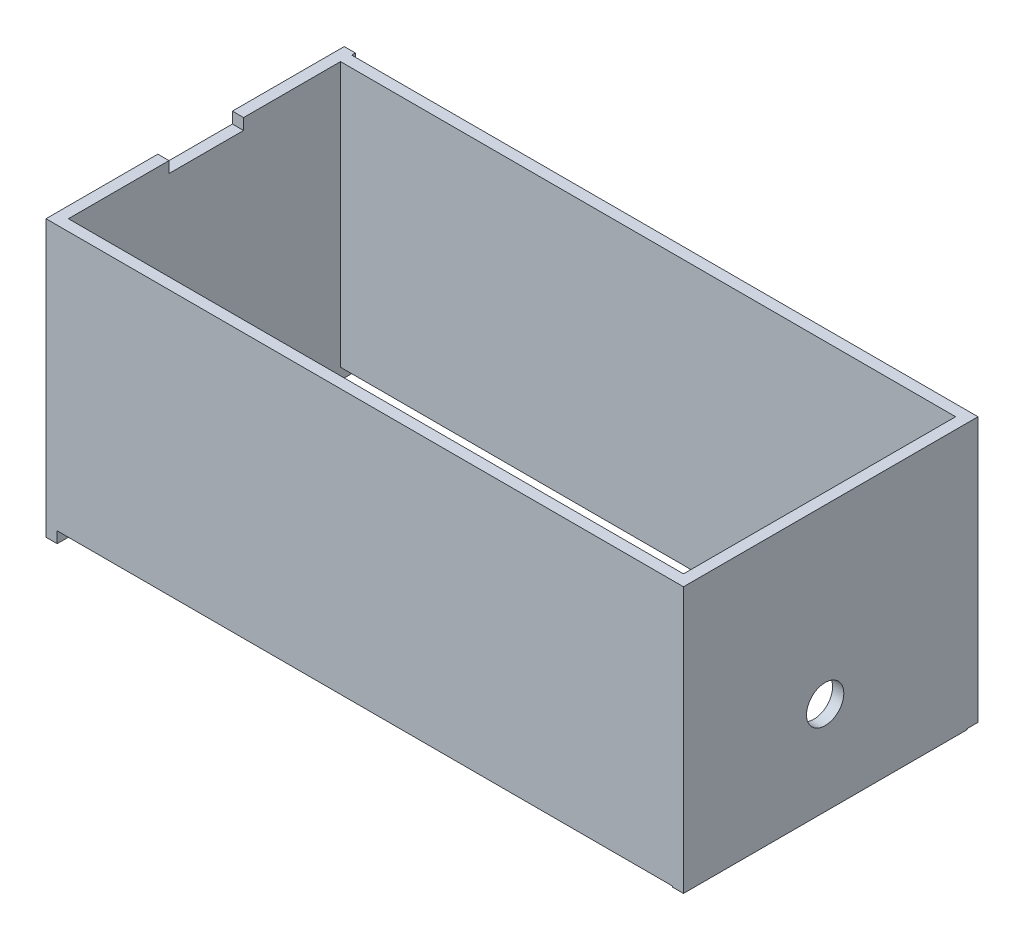
ISO-10303-21;
HEADER;
FILE_DESCRIPTION(('STEP AP214'),'2;1');
FILE_NAME('part.step','',(''),(''),'','','');
FILE_SCHEMA(('AUTOMOTIVE_DESIGN { 1 0 10303 214 1 1 1 1 }'));
ENDSEC;
DATA;
#1=APPLICATION_CONTEXT('core data for automotive mechanical design processes');
#2=APPLICATION_PROTOCOL_DEFINITION('international standard','automotive_design',2000,#1);
#3=PRODUCT_CONTEXT('',#1,'mechanical');
#4=PRODUCT('Part','Part','',(#3));
#5=PRODUCT_RELATED_PRODUCT_CATEGORY('part','',(#4));
#6=PRODUCT_DEFINITION_FORMATION('','',#4);
#7=PRODUCT_DEFINITION_CONTEXT('part definition',#1,'design');
#8=PRODUCT_DEFINITION('design','',#6,#7);
#9=PRODUCT_DEFINITION_SHAPE('','',#8);
#10=(LENGTH_UNIT() NAMED_UNIT(*) SI_UNIT(.MILLI.,.METRE.));
#11=(NAMED_UNIT(*) PLANE_ANGLE_UNIT() SI_UNIT($,.RADIAN.));
#12=(NAMED_UNIT(*) SI_UNIT($,.STERADIAN.) SOLID_ANGLE_UNIT());
#13=UNCERTAINTY_MEASURE_WITH_UNIT(LENGTH_MEASURE(1.E-05),#10,'distance_accuracy_value','');
#14=(GEOMETRIC_REPRESENTATION_CONTEXT(3) GLOBAL_UNCERTAINTY_ASSIGNED_CONTEXT((#13)) GLOBAL_UNIT_ASSIGNED_CONTEXT((#10,
#11,#12)) REPRESENTATION_CONTEXT('',''));
#15=CARTESIAN_POINT('',(0.,0.,0.));
#16=DIRECTION('',(0.,0.,1.));
#17=DIRECTION('',(1.,0.,0.));
#18=AXIS2_PLACEMENT_3D('',#15,#16,#17);
#19=CARTESIAN_POINT('',(-71.7735849056604,-19.8470716253272,3.));
#20=DIRECTION('',(0.,1.,0.));
#21=DIRECTION('',(0.,0.,1.));
#22=AXIS2_PLACEMENT_3D('',#19,#20,#21);
#23=PLANE('',#22);
#24=DIRECTION('',(1.,0.,0.));
#25=VECTOR('',#24,1.);
#26=CARTESIAN_POINT('',(-71.7735849056604,-19.8470716253272,0.));
#27=LINE('',#26,#25);
#28=CARTESIAN_POINT('',(-68.7735849056604,-19.8470716253272,0.));
#29=VERTEX_POINT('',#28);
#30=CARTESIAN_POINT('',(96.2264150943396,-19.8470716253272,0.));
#31=VERTEX_POINT('',#30);
#32=EDGE_CURVE('E270',#29,#31,#27,.T.);
#33=ORIENTED_EDGE('',*,*,#32,.T.);
#34=DIRECTION('',(0.,0.,1.));
#35=VECTOR('',#34,1.);
#36=CARTESIAN_POINT('',(96.2264150943396,-19.8470716253272,3.));
#37=LINE('',#36,#35);
#38=CARTESIAN_POINT('',(96.2264150943396,-19.8470716253272,2.99999999999999));
#39=VERTEX_POINT('',#38);
#40=EDGE_CURVE('E214',#31,#39,#37,.T.);
#41=ORIENTED_EDGE('',*,*,#40,.T.);
#42=DIRECTION('',(1.,0.,0.));
#43=VECTOR('',#42,1.);
#44=CARTESIAN_POINT('',(-71.7735849056604,-19.8470716253272,3.));
#45=LINE('',#44,#43);
#46=CARTESIAN_POINT('',(-68.7735849056604,-19.8470716253272,3.));
#47=VERTEX_POINT('',#46);
#48=EDGE_CURVE('E287',#47,#39,#45,.T.);
#49=ORIENTED_EDGE('',*,*,#48,.F.);
#50=DIRECTION('',(0.,0.,1.));
#51=VECTOR('',#50,1.);
#52=CARTESIAN_POINT('',(-68.7735849056604,-19.8470716253272,0.));
#53=LINE('',#52,#51);
#54=EDGE_CURVE('E243',#29,#47,#53,.T.);
#55=ORIENTED_EDGE('',*,*,#54,.F.);
#56=EDGE_LOOP('',(#33,#41,#49,#55));
#57=FACE_BOUND('',#56,.T.);
#58=ADVANCED_FACE('F37',(#57),#23,.F.);
#59=CARTESIAN_POINT('',(0.,0.,0.));
#60=DIRECTION('',(0.,0.,1.));
#61=DIRECTION('',(1.,0.,0.));
#62=AXIS2_PLACEMENT_3D('',#59,#60,#61);
#63=PLANE('',#62);
#64=DIRECTION('',(-1.,0.,0.));
#65=VECTOR('',#64,1.);
#66=CARTESIAN_POINT('',(-71.7735849056604,51.1529283746728,0.));
#67=LINE('',#66,#65);
#68=CARTESIAN_POINT('',(96.2264150943396,51.1529283746728,0.));
#69=VERTEX_POINT('',#68);
#70=CARTESIAN_POINT('',(-68.7735849056604,51.1529283746728,0.));
#71=VERTEX_POINT('',#70);
#72=EDGE_CURVE('E288',#69,#71,#67,.T.);
#73=ORIENTED_EDGE('',*,*,#72,.F.);
#74=DIRECTION('',(0.,-1.,0.));
#75=VECTOR('',#74,1.);
#76=CARTESIAN_POINT('',(96.2264150943396,0.,0.));
#77=LINE('',#76,#75);
#78=EDGE_CURVE('E209',#69,#31,#77,.T.);
#79=ORIENTED_EDGE('',*,*,#78,.T.);
#80=ORIENTED_EDGE('',*,*,#32,.F.);
#81=DIRECTION('',(0.,-1.,0.));
#82=VECTOR('',#81,1.);
#83=CARTESIAN_POINT('',(-68.7735849056604,0.,0.));
#84=LINE('',#83,#82);
#85=EDGE_CURVE('E246',#71,#29,#84,.T.);
#86=ORIENTED_EDGE('',*,*,#85,.F.);
#87=EDGE_LOOP('',(#73,#79,#80,#86));
#88=FACE_BOUND('',#87,.T.);
#89=ADVANCED_FACE('F349',(#88),#63,.F.);
#90=CARTESIAN_POINT('',(-71.7735849056604,51.1529283746728,3.));
#91=DIRECTION('',(1.,0.,0.));
#92=DIRECTION('',(0.,0.,-1.));
#93=AXIS2_PLACEMENT_3D('',#90,#91,#92);
#94=PLANE('',#93);
#95=DIRECTION('',(0.,0.,-1.));
#96=VECTOR('',#95,1.);
#97=CARTESIAN_POINT('',(-71.7735849056604,51.1529283746728,0.));
#98=LINE('',#97,#96);
#99=CARTESIAN_POINT('',(-71.7735849056604,51.1529283746728,-47.));
#100=VERTEX_POINT('',#99);
#101=CARTESIAN_POINT('',(-71.7735849056604,51.1529283746728,-77.));
#102=VERTEX_POINT('',#101);
#103=EDGE_CURVE('E252',#100,#102,#98,.T.);
#104=ORIENTED_EDGE('',*,*,#103,.T.);
#105=DIRECTION('',(0.,-1.,0.));
#106=VECTOR('',#105,1.);
#107=CARTESIAN_POINT('',(-71.7735849056604,0.,-77.));
#108=LINE('',#107,#106);
#109=CARTESIAN_POINT('',(-71.7735849056604,-22.8470716253272,-77.));
#110=VERTEX_POINT('',#109);
#111=EDGE_CURVE('E254',#102,#110,#108,.T.);
#112=ORIENTED_EDGE('',*,*,#111,.T.);
#113=DIRECTION('',(0.,0.,-1.));
#114=VECTOR('',#113,1.);
#115=CARTESIAN_POINT('',(-71.7735849056604,-22.8470716253272,0.));
#116=LINE('',#115,#114);
#117=CARTESIAN_POINT('',(-71.7735849056604,-22.8470716253272,3.00000000000001));
#118=VERTEX_POINT('',#117);
#119=EDGE_CURVE('E222',#118,#110,#116,.T.);
#120=ORIENTED_EDGE('',*,*,#119,.F.);
#121=DIRECTION('',(0.,-1.,0.));
#122=VECTOR('',#121,1.);
#123=CARTESIAN_POINT('',(-71.7735849056604,51.1529283746728,3.));
#124=LINE('',#123,#122);
#125=CARTESIAN_POINT('',(-71.7735849056604,51.1529283746728,3.));
#126=VERTEX_POINT('',#125);
#127=EDGE_CURVE('E285',#126,#118,#124,.T.);
#128=ORIENTED_EDGE('',*,*,#127,.F.);
#129=DIRECTION('',(0.,0.,-1.));
#130=VECTOR('',#129,1.);
#131=CARTESIAN_POINT('',(-71.7735849056604,51.1529283746728,3.));
#132=LINE('',#131,#130);
#133=CARTESIAN_POINT('',(-71.7735849056604,51.1529283746728,-27.));
#134=VERTEX_POINT('',#133);
#135=EDGE_CURVE('E295',#126,#134,#132,.T.);
#136=ORIENTED_EDGE('',*,*,#135,.T.);
#137=DIRECTION('',(0.,-1.,0.));
#138=VECTOR('',#137,1.);
#139=CARTESIAN_POINT('',(-71.7735849056604,0.,-27.));
#140=LINE('',#139,#138);
#141=CARTESIAN_POINT('',(-71.7735849056604,48.1529283746728,-27.));
#142=VERTEX_POINT('',#141);
#143=EDGE_CURVE('E251',#134,#142,#140,.T.);
#144=ORIENTED_EDGE('',*,*,#143,.T.);
#145=DIRECTION('',(0.,0.,1.));
#146=VECTOR('',#145,1.);
#147=CARTESIAN_POINT('',(-71.7735849056604,48.1529283746728,0.));
#148=LINE('',#147,#146);
#149=CARTESIAN_POINT('',(-71.7735849056604,48.1529283746728,-47.));
#150=VERTEX_POINT('',#149);
#151=EDGE_CURVE('E258',#150,#142,#148,.T.);
#152=ORIENTED_EDGE('',*,*,#151,.F.);
#153=DIRECTION('',(0.,-1.,0.));
#154=VECTOR('',#153,1.);
#155=CARTESIAN_POINT('',(-71.7735849056604,0.,-47.));
#156=LINE('',#155,#154);
#157=EDGE_CURVE('E255',#100,#150,#156,.T.);
#158=ORIENTED_EDGE('',*,*,#157,.F.);
#159=EDGE_LOOP('',(#104,#112,#120,#128,#136,#144,#152,#158));
#160=FACE_BOUND('',#159,.T.);
#161=CARTESIAN_POINT('',(-71.7735849056604,2.15292837467277,-39.));
#162=DIRECTION('',(-1.,0.,0.));
#163=DIRECTION('',(0.,0.,1.));
#164=AXIS2_PLACEMENT_3D('',#161,#162,#163);
#165=CIRCLE('',#164,5.);
#166=CARTESIAN_POINT('',(-71.7735849056604,2.15292837467277,-34.));
#167=VERTEX_POINT('',#166);
#168=EDGE_CURVE('E217',#167,#167,#165,.T.);
#169=ORIENTED_EDGE('',*,*,#168,.F.);
#170=EDGE_LOOP('',(#169));
#171=FACE_BOUND('',#170,.T.);
#172=ADVANCED_FACE('F39',(#160,#171),#94,.F.);
#173=CARTESIAN_POINT('',(99.2264150943396,51.1529283746728,3.));
#174=DIRECTION('',(-1.,0.,0.));
#175=DIRECTION('',(0.,-1.,0.));
#176=AXIS2_PLACEMENT_3D('',#173,#174,#175);
#177=PLANE('',#176);
#178=DIRECTION('',(0.,1.,0.));
#179=VECTOR('',#178,1.);
#180=CARTESIAN_POINT('',(99.2264150943396,51.1529283746728,3.));
#181=LINE('',#180,#179);
#182=CARTESIAN_POINT('',(99.2264150943396,-20.0959784944851,2.99999999999999));
#183=VERTEX_POINT('',#182);
#184=CARTESIAN_POINT('',(99.2264150943396,51.1529283746728,3.));
#185=VERTEX_POINT('',#184);
#186=EDGE_CURVE('E291',#183,#185,#181,.T.);
#187=ORIENTED_EDGE('',*,*,#186,.F.);
#188=DIRECTION('',(0.,0.,-1.));
#189=VECTOR('',#188,1.);
#190=CARTESIAN_POINT('',(99.2264150943396,-20.0959784944851,-73.));
#191=LINE('',#190,#189);
#192=CARTESIAN_POINT('',(99.2264150943396,-20.0959784944851,-73.));
#193=VERTEX_POINT('',#192);
#194=EDGE_CURVE('E196',#183,#193,#191,.T.);
#195=ORIENTED_EDGE('',*,*,#194,.T.);
#196=DIRECTION('',(0.,1.,0.));
#197=VECTOR('',#196,1.);
#198=CARTESIAN_POINT('',(99.2264150943396,51.1529283746728,-73.));
#199=LINE('',#198,#197);
#200=CARTESIAN_POINT('',(99.2264150943396,-19.8470716253272,-73.));
#201=VERTEX_POINT('',#200);
#202=EDGE_CURVE('E179',#193,#201,#199,.T.);
#203=ORIENTED_EDGE('',*,*,#202,.T.);
#204=DIRECTION('',(0.,0.,1.));
#205=VECTOR('',#204,1.);
#206=CARTESIAN_POINT('',(99.2264150943396,-19.8470716253272,-76.));
#207=LINE('',#206,#205);
#208=CARTESIAN_POINT('',(99.2264150943396,-19.8470716253272,-76.));
#209=VERTEX_POINT('',#208);
#210=EDGE_CURVE('E163',#209,#201,#207,.T.);
#211=ORIENTED_EDGE('',*,*,#210,.F.);
#212=DIRECTION('',(0.,-1.,0.));
#213=VECTOR('',#212,1.);
#214=CARTESIAN_POINT('',(99.2264150943396,51.1529283746728,-76.));
#215=LINE('',#214,#213);
#216=CARTESIAN_POINT('',(99.2264150943396,51.1529283746728,-76.));
#217=VERTEX_POINT('',#216);
#218=EDGE_CURVE('E166',#217,#209,#215,.T.);
#219=ORIENTED_EDGE('',*,*,#218,.F.);
#220=DIRECTION('',(0.,0.,-1.));
#221=VECTOR('',#220,1.);
#222=CARTESIAN_POINT('',(99.2264150943396,51.1529283746728,3.));
#223=LINE('',#222,#221);
#224=EDGE_CURVE('E300',#185,#217,#223,.T.);
#225=ORIENTED_EDGE('',*,*,#224,.F.);
#226=EDGE_LOOP('',(#187,#195,#203,#211,#219,#225));
#227=FACE_BOUND('',#226,.T.);
#228=CARTESIAN_POINT('',(99.2264150943396,4.90402150551492,-35.));
#229=DIRECTION('',(1.,0.,0.));
#230=DIRECTION('',(0.,1.,0.));
#231=AXIS2_PLACEMENT_3D('',#228,#229,#230);
#232=CIRCLE('',#231,5.);
#233=CARTESIAN_POINT('',(99.2264150943396,9.90402150551492,-35.));
#234=VERTEX_POINT('',#233);
#235=EDGE_CURVE('E183',#234,#234,#232,.T.);
#236=ORIENTED_EDGE('',*,*,#235,.F.);
#237=EDGE_LOOP('',(#236));
#238=FACE_BOUND('',#237,.T.);
#239=ADVANCED_FACE('F176',(#227,#238),#177,.F.);
#240=CARTESIAN_POINT('',(-71.7735849056604,51.1529283746728,3.));
#241=DIRECTION('',(0.,-1.,0.));
#242=DIRECTION('',(0.,0.,-1.));
#243=AXIS2_PLACEMENT_3D('',#240,#241,#242);
#244=PLANE('',#243);
#245=ORIENTED_EDGE('',*,*,#135,.F.);
#246=DIRECTION('',(-1.,0.,0.));
#247=VECTOR('',#246,1.);
#248=CARTESIAN_POINT('',(-71.7735849056604,51.1529283746728,3.));
#249=LINE('',#248,#247);
#250=EDGE_CURVE('E293',#185,#126,#249,.T.);
#251=ORIENTED_EDGE('',*,*,#250,.F.);
#252=ORIENTED_EDGE('',*,*,#224,.T.);
#253=DIRECTION('',(1.,0.,0.));
#254=VECTOR('',#253,1.);
#255=CARTESIAN_POINT('',(99.2264150943396,51.1529283746728,-76.));
#256=LINE('',#255,#254);
#257=CARTESIAN_POINT('',(-68.7735849056604,51.1529283746728,-76.));
#258=VERTEX_POINT('',#257);
#259=EDGE_CURVE('E165',#258,#217,#256,.T.);
#260=ORIENTED_EDGE('',*,*,#259,.F.);
#261=DIRECTION('',(0.,0.,-1.));
#262=VECTOR('',#261,1.);
#263=CARTESIAN_POINT('',(-68.7735849056604,51.1529283746728,0.));
#264=LINE('',#263,#262);
#265=CARTESIAN_POINT('',(-68.7735849056604,51.1529283746728,-77.));
#266=VERTEX_POINT('',#265);
#267=EDGE_CURVE('E226',#258,#266,#264,.T.);
#268=ORIENTED_EDGE('',*,*,#267,.T.);
#269=DIRECTION('',(-1.,0.,0.));
#270=VECTOR('',#269,1.);
#271=CARTESIAN_POINT('',(-68.7735849056604,51.1529283746728,-77.));
#272=LINE('',#271,#270);
#273=EDGE_CURVE('E273',#266,#102,#272,.T.);
#274=ORIENTED_EDGE('',*,*,#273,.T.);
#275=ORIENTED_EDGE('',*,*,#103,.F.);
#276=DIRECTION('',(-1.,0.,0.));
#277=VECTOR('',#276,1.);
#278=CARTESIAN_POINT('',(-68.7735849056604,51.1529283746728,-47.));
#279=LINE('',#278,#277);
#280=CARTESIAN_POINT('',(-68.7735849056604,51.1529283746728,-47.));
#281=VERTEX_POINT('',#280);
#282=EDGE_CURVE('E276',#281,#100,#279,.T.);
#283=ORIENTED_EDGE('',*,*,#282,.F.);
#284=CARTESIAN_POINT('',(-68.7735849056604,51.1529283746728,-73.));
#285=VERTEX_POINT('',#284);
#286=EDGE_CURVE('E227',#281,#285,#264,.T.);
#287=ORIENTED_EDGE('',*,*,#286,.T.);
#288=DIRECTION('',(1.,0.,0.));
#289=VECTOR('',#288,1.);
#290=CARTESIAN_POINT('',(99.2264150943396,51.1529283746728,-73.));
#291=LINE('',#290,#289);
#292=CARTESIAN_POINT('',(96.2264150943396,51.1529283746728,-73.));
#293=VERTEX_POINT('',#292);
#294=EDGE_CURVE('E174',#285,#293,#291,.T.);
#295=ORIENTED_EDGE('',*,*,#294,.T.);
#296=DIRECTION('',(0.,0.,1.));
#297=VECTOR('',#296,1.);
#298=CARTESIAN_POINT('',(96.2264150943396,51.1529283746728,-73.));
#299=LINE('',#298,#297);
#300=EDGE_CURVE('E195',#293,#69,#299,.T.);
#301=ORIENTED_EDGE('',*,*,#300,.T.);
#302=ORIENTED_EDGE('',*,*,#72,.T.);
#303=CARTESIAN_POINT('',(-68.7735849056604,51.1529283746728,-27.));
#304=VERTEX_POINT('',#303);
#305=EDGE_CURVE('E221',#71,#304,#264,.T.);
#306=ORIENTED_EDGE('',*,*,#305,.T.);
#307=DIRECTION('',(-1.,0.,0.));
#308=VECTOR('',#307,1.);
#309=CARTESIAN_POINT('',(-68.7735849056604,51.1529283746728,-27.));
#310=LINE('',#309,#308);
#311=EDGE_CURVE('E248',#304,#134,#310,.T.);
#312=ORIENTED_EDGE('',*,*,#311,.T.);
#313=EDGE_LOOP('',(#245,#251,#252,#260,#268,#274,#275,#283,#287,#295,#301,#302,#306,#312));
#314=FACE_BOUND('',#313,.T.);
#315=ADVANCED_FACE('F314',(#314),#244,.F.);
#316=CARTESIAN_POINT('',(0.,0.,3.));
#317=DIRECTION('',(0.,0.,1.));
#318=DIRECTION('',(1.,0.,0.));
#319=AXIS2_PLACEMENT_3D('',#316,#317,#318);
#320=PLANE('',#319);
#321=ORIENTED_EDGE('',*,*,#48,.T.);
#322=DIRECTION('',(0.,-1.,0.));
#323=VECTOR('',#322,1.);
#324=CARTESIAN_POINT('',(96.2264150943396,51.1529283746728,3.));
#325=LINE('',#324,#323);
#326=CARTESIAN_POINT('',(96.2264150943396,-20.0959784944851,2.99999999999999));
#327=VERTEX_POINT('',#326);
#328=EDGE_CURVE('E199',#39,#327,#325,.T.);
#329=ORIENTED_EDGE('',*,*,#328,.T.);
#330=DIRECTION('',(1.,0.,0.));
#331=VECTOR('',#330,1.);
#332=CARTESIAN_POINT('',(96.2264150943396,-20.0959784944851,2.99999999999999));
#333=LINE('',#332,#331);
#334=EDGE_CURVE('E204',#327,#183,#333,.T.);
#335=ORIENTED_EDGE('',*,*,#334,.T.);
#336=ORIENTED_EDGE('',*,*,#186,.T.);
#337=ORIENTED_EDGE('',*,*,#250,.T.);
#338=ORIENTED_EDGE('',*,*,#127,.T.);
#339=DIRECTION('',(-1.,0.,0.));
#340=VECTOR('',#339,1.);
#341=CARTESIAN_POINT('',(-68.7735849056604,-22.8470716253272,3.00000000000001));
#342=LINE('',#341,#340);
#343=CARTESIAN_POINT('',(-68.7735849056604,-22.8470716253272,3.00000000000001));
#344=VERTEX_POINT('',#343);
#345=EDGE_CURVE('E267',#344,#118,#342,.T.);
#346=ORIENTED_EDGE('',*,*,#345,.F.);
#347=DIRECTION('',(0.,-1.,0.));
#348=VECTOR('',#347,1.);
#349=CARTESIAN_POINT('',(-68.7735849056604,0.,3.00000000000001));
#350=LINE('',#349,#348);
#351=EDGE_CURVE('E240',#47,#344,#350,.T.);
#352=ORIENTED_EDGE('',*,*,#351,.F.);
#353=EDGE_LOOP('',(#321,#329,#335,#336,#337,#338,#346,#352));
#354=FACE_BOUND('',#353,.T.);
#355=ADVANCED_FACE('F353',(#354),#320,.T.);
#356=CARTESIAN_POINT('',(-68.7735849056604,-22.8470716253272,0.));
#357=DIRECTION('',(0.,1.,0.));
#358=DIRECTION('',(0.,0.,1.));
#359=AXIS2_PLACEMENT_3D('',#356,#357,#358);
#360=PLANE('',#359);
#361=ORIENTED_EDGE('',*,*,#119,.T.);
#362=DIRECTION('',(-1.,0.,0.));
#363=VECTOR('',#362,1.);
#364=CARTESIAN_POINT('',(-68.7735849056604,-22.8470716253272,-77.));
#365=LINE('',#364,#363);
#366=CARTESIAN_POINT('',(-68.7735849056604,-22.8470716253272,-77.));
#367=VERTEX_POINT('',#366);
#368=EDGE_CURVE('E271',#367,#110,#365,.T.);
#369=ORIENTED_EDGE('',*,*,#368,.F.);
#370=DIRECTION('',(0.,0.,-1.));
#371=VECTOR('',#370,1.);
#372=CARTESIAN_POINT('',(-68.7735849056604,-22.8470716253272,0.));
#373=LINE('',#372,#371);
#374=EDGE_CURVE('E238',#344,#367,#373,.T.);
#375=ORIENTED_EDGE('',*,*,#374,.F.);
#376=ORIENTED_EDGE('',*,*,#345,.T.);
#377=EDGE_LOOP('',(#361,#369,#375,#376));
#378=FACE_BOUND('',#377,.T.);
#379=ADVANCED_FACE('F327',(#378),#360,.F.);
#380=CARTESIAN_POINT('',(-68.7735849056604,0.,-77.));
#381=DIRECTION('',(0.,0.,-1.));
#382=DIRECTION('',(-1.,0.,0.));
#383=AXIS2_PLACEMENT_3D('',#380,#381,#382);
#384=PLANE('',#383);
#385=ORIENTED_EDGE('',*,*,#111,.F.);
#386=ORIENTED_EDGE('',*,*,#273,.F.);
#387=DIRECTION('',(0.,-1.,0.));
#388=VECTOR('',#387,1.);
#389=CARTESIAN_POINT('',(-68.7735849056604,0.,-77.));
#390=LINE('',#389,#388);
#391=EDGE_CURVE('E235',#266,#367,#390,.T.);
#392=ORIENTED_EDGE('',*,*,#391,.T.);
#393=ORIENTED_EDGE('',*,*,#368,.T.);
#394=EDGE_LOOP('',(#385,#386,#392,#393));
#395=FACE_BOUND('',#394,.T.);
#396=ADVANCED_FACE('F322',(#395),#384,.T.);
#397=CARTESIAN_POINT('',(-68.7735849056604,0.,-47.));
#398=DIRECTION('',(0.,0.,-1.));
#399=DIRECTION('',(-1.,0.,0.));
#400=AXIS2_PLACEMENT_3D('',#397,#398,#399);
#401=PLANE('',#400);
#402=ORIENTED_EDGE('',*,*,#157,.T.);
#403=DIRECTION('',(-1.,0.,0.));
#404=VECTOR('',#403,1.);
#405=CARTESIAN_POINT('',(-68.7735849056604,48.1529283746728,-47.));
#406=LINE('',#405,#404);
#407=CARTESIAN_POINT('',(-68.7735849056604,48.1529283746728,-47.));
#408=VERTEX_POINT('',#407);
#409=EDGE_CURVE('E278',#408,#150,#406,.T.);
#410=ORIENTED_EDGE('',*,*,#409,.F.);
#411=DIRECTION('',(0.,-1.,0.));
#412=VECTOR('',#411,1.);
#413=CARTESIAN_POINT('',(-68.7735849056604,0.,-47.));
#414=LINE('',#413,#412);
#415=EDGE_CURVE('E232',#281,#408,#414,.T.);
#416=ORIENTED_EDGE('',*,*,#415,.F.);
#417=ORIENTED_EDGE('',*,*,#282,.T.);
#418=EDGE_LOOP('',(#402,#410,#416,#417));
#419=FACE_BOUND('',#418,.T.);
#420=ADVANCED_FACE('F335',(#419),#401,.F.);
#421=CARTESIAN_POINT('',(-68.7735849056604,48.1529283746728,0.));
#422=DIRECTION('',(0.,-1.,0.));
#423=DIRECTION('',(0.,0.,-1.));
#424=AXIS2_PLACEMENT_3D('',#421,#422,#423);
#425=PLANE('',#424);
#426=ORIENTED_EDGE('',*,*,#151,.T.);
#427=DIRECTION('',(-1.,0.,0.));
#428=VECTOR('',#427,1.);
#429=CARTESIAN_POINT('',(-68.7735849056604,48.1529283746728,-27.));
#430=LINE('',#429,#428);
#431=CARTESIAN_POINT('',(-68.7735849056604,48.1529283746728,-27.));
#432=VERTEX_POINT('',#431);
#433=EDGE_CURVE('E281',#432,#142,#430,.T.);
#434=ORIENTED_EDGE('',*,*,#433,.F.);
#435=DIRECTION('',(0.,0.,1.));
#436=VECTOR('',#435,1.);
#437=CARTESIAN_POINT('',(-68.7735849056604,48.1529283746728,0.));
#438=LINE('',#437,#436);
#439=EDGE_CURVE('E230',#408,#432,#438,.T.);
#440=ORIENTED_EDGE('',*,*,#439,.F.);
#441=ORIENTED_EDGE('',*,*,#409,.T.);
#442=EDGE_LOOP('',(#426,#434,#440,#441));
#443=FACE_BOUND('',#442,.T.);
#444=ADVANCED_FACE('F340',(#443),#425,.F.);
#445=CARTESIAN_POINT('',(-68.7735849056604,2.15292837467277,-39.));
#446=DIRECTION('',(-1.,0.,0.));
#447=DIRECTION('',(0.,0.,1.));
#448=AXIS2_PLACEMENT_3D('',#445,#446,#447);
#449=CYLINDRICAL_SURFACE('',#448,5.);
#450=CARTESIAN_POINT('',(-68.7735849056604,2.15292837467277,-39.));
#451=DIRECTION('',(-1.,0.,0.));
#452=DIRECTION('',(0.,0.,1.));
#453=AXIS2_PLACEMENT_3D('',#450,#451,#452);
#454=CIRCLE('',#453,5.);
#455=CARTESIAN_POINT('',(-68.7735849056604,2.15292837467277,-34.));
#456=VERTEX_POINT('',#455);
#457=EDGE_CURVE('E218',#456,#456,#454,.T.);
#458=ORIENTED_EDGE('',*,*,#457,.F.);
#459=EDGE_LOOP('',(#458));
#460=FACE_BOUND('',#459,.T.);
#461=ORIENTED_EDGE('',*,*,#168,.T.);
#462=EDGE_LOOP('',(#461));
#463=FACE_BOUND('',#462,.T.);
#464=ADVANCED_FACE('F385',(#460,#463),#449,.F.);
#465=CARTESIAN_POINT('',(-68.7735849056604,0.,-27.));
#466=DIRECTION('',(0.,0.,-1.));
#467=DIRECTION('',(-1.,0.,0.));
#468=AXIS2_PLACEMENT_3D('',#465,#466,#467);
#469=PLANE('',#468);
#470=ORIENTED_EDGE('',*,*,#143,.F.);
#471=ORIENTED_EDGE('',*,*,#311,.F.);
#472=DIRECTION('',(0.,-1.,0.));
#473=VECTOR('',#472,1.);
#474=CARTESIAN_POINT('',(-68.7735849056604,0.,-27.));
#475=LINE('',#474,#473);
#476=EDGE_CURVE('E225',#304,#432,#475,.T.);
#477=ORIENTED_EDGE('',*,*,#476,.T.);
#478=ORIENTED_EDGE('',*,*,#433,.T.);
#479=EDGE_LOOP('',(#470,#471,#477,#478));
#480=FACE_BOUND('',#479,.T.);
#481=ADVANCED_FACE('F343',(#480),#469,.T.);
#482=CARTESIAN_POINT('',(-68.7735849056604,0.,0.));
#483=DIRECTION('',(-1.,0.,0.));
#484=DIRECTION('',(0.,0.,1.));
#485=AXIS2_PLACEMENT_3D('',#482,#483,#484);
#486=PLANE('',#485);
#487=ORIENTED_EDGE('',*,*,#457,.T.);
#488=EDGE_LOOP('',(#487));
#489=FACE_BOUND('',#488,.T.);
#490=ORIENTED_EDGE('',*,*,#267,.F.);
#491=DIRECTION('',(0.,-1.,0.));
#492=VECTOR('',#491,1.);
#493=CARTESIAN_POINT('',(-68.7735849056604,0.,-76.));
#494=LINE('',#493,#492);
#495=CARTESIAN_POINT('',(-68.7735849056604,-19.8470716253272,-76.));
#496=VERTEX_POINT('',#495);
#497=EDGE_CURVE('E11',#258,#496,#494,.T.);
#498=ORIENTED_EDGE('',*,*,#497,.T.);
#499=DIRECTION('',(0.,0.,-1.));
#500=VECTOR('',#499,1.);
#501=CARTESIAN_POINT('',(-68.7735849056604,-19.8470716253273,0.));
#502=LINE('',#501,#500);
#503=CARTESIAN_POINT('',(-68.7735849056604,-19.8470716253272,-73.));
#504=VERTEX_POINT('',#503);
#505=EDGE_CURVE('E45',#504,#496,#502,.T.);
#506=ORIENTED_EDGE('',*,*,#505,.F.);
#507=DIRECTION('',(0.,-1.,0.));
#508=VECTOR('',#507,1.);
#509=CARTESIAN_POINT('',(-68.7735849056604,0.,-73.));
#510=LINE('',#509,#508);
#511=EDGE_CURVE('E302',#285,#504,#510,.T.);
#512=ORIENTED_EDGE('',*,*,#511,.F.);
#513=ORIENTED_EDGE('',*,*,#286,.F.);
#514=ORIENTED_EDGE('',*,*,#415,.T.);
#515=ORIENTED_EDGE('',*,*,#439,.T.);
#516=ORIENTED_EDGE('',*,*,#476,.F.);
#517=ORIENTED_EDGE('',*,*,#305,.F.);
#518=ORIENTED_EDGE('',*,*,#85,.T.);
#519=ORIENTED_EDGE('',*,*,#54,.T.);
#520=ORIENTED_EDGE('',*,*,#351,.T.);
#521=ORIENTED_EDGE('',*,*,#374,.T.);
#522=ORIENTED_EDGE('',*,*,#391,.F.);
#523=EDGE_LOOP('',(#490,#498,#506,#512,#513,#514,#515,#516,#517,#518,#519,#520,#521,#522));
#524=FACE_BOUND('',#523,.T.);
#525=ADVANCED_FACE('F323',(#489,#524),#486,.F.);
#526=CARTESIAN_POINT('',(96.2264150943396,0.,0.));
#527=DIRECTION('',(-1.,0.,0.));
#528=DIRECTION('',(0.,-1.,0.));
#529=AXIS2_PLACEMENT_3D('',#526,#527,#528);
#530=PLANE('',#529);
#531=CARTESIAN_POINT('',(96.2264150943396,4.90402150551493,-35.));
#532=DIRECTION('',(1.,0.,0.));
#533=DIRECTION('',(0.,1.,0.));
#534=AXIS2_PLACEMENT_3D('',#531,#532,#533);
#535=CIRCLE('',#534,5.);
#536=CARTESIAN_POINT('',(96.2264150943396,9.90402150551492,-35.));
#537=VERTEX_POINT('',#536);
#538=EDGE_CURVE('E190',#537,#537,#535,.T.);
#539=ORIENTED_EDGE('',*,*,#538,.T.);
#540=EDGE_LOOP('',(#539));
#541=FACE_BOUND('',#540,.T.);
#542=ORIENTED_EDGE('',*,*,#40,.F.);
#543=ORIENTED_EDGE('',*,*,#78,.F.);
#544=ORIENTED_EDGE('',*,*,#300,.F.);
#545=DIRECTION('',(0.,1.,0.));
#546=VECTOR('',#545,1.);
#547=CARTESIAN_POINT('',(96.2264150943396,51.1529283746728,-73.));
#548=LINE('',#547,#546);
#549=CARTESIAN_POINT('',(96.2264150943396,-19.8470716253272,-73.));
#550=VERTEX_POINT('',#549);
#551=EDGE_CURVE('E180',#550,#293,#548,.T.);
#552=ORIENTED_EDGE('',*,*,#551,.F.);
#553=CARTESIAN_POINT('',(96.2264150943396,-20.0959784944851,-73.));
#554=VERTEX_POINT('',#553);
#555=EDGE_CURVE('E185',#554,#550,#548,.T.);
#556=ORIENTED_EDGE('',*,*,#555,.F.);
#557=DIRECTION('',(0.,0.,-1.));
#558=VECTOR('',#557,1.);
#559=CARTESIAN_POINT('',(96.2264150943396,-20.0959784944851,-73.));
#560=LINE('',#559,#558);
#561=EDGE_CURVE('E201',#327,#554,#560,.T.);
#562=ORIENTED_EDGE('',*,*,#561,.F.);
#563=ORIENTED_EDGE('',*,*,#328,.F.);
#564=EDGE_LOOP('',(#542,#543,#544,#552,#556,#562,#563));
#565=FACE_BOUND('',#564,.T.);
#566=ADVANCED_FACE('F362',(#541,#565),#530,.T.);
#567=CARTESIAN_POINT('',(96.2264150943396,51.1529283746728,-73.));
#568=DIRECTION('',(0.,0.,-1.));
#569=DIRECTION('',(0.,1.,0.));
#570=AXIS2_PLACEMENT_3D('',#567,#568,#569);
#571=PLANE('',#570);
#572=DIRECTION('',(-1.,0.,0.));
#573=VECTOR('',#572,1.);
#574=CARTESIAN_POINT('',(99.2264150943396,-19.8470716253272,-73.));
#575=LINE('',#574,#573);
#576=EDGE_CURVE('E52',#201,#550,#575,.T.);
#577=ORIENTED_EDGE('',*,*,#576,.F.);
#578=ORIENTED_EDGE('',*,*,#202,.F.);
#579=DIRECTION('',(1.,0.,0.));
#580=VECTOR('',#579,1.);
#581=CARTESIAN_POINT('',(96.2264150943396,-20.0959784944851,-73.));
#582=LINE('',#581,#580);
#583=EDGE_CURVE('E207',#554,#193,#582,.T.);
#584=ORIENTED_EDGE('',*,*,#583,.F.);
#585=ORIENTED_EDGE('',*,*,#555,.T.);
#586=EDGE_LOOP('',(#577,#578,#584,#585));
#587=FACE_BOUND('',#586,.T.);
#588=ADVANCED_FACE('F360',(#587),#571,.T.);
#589=CARTESIAN_POINT('',(96.2264150943396,-20.0959784944851,-73.));
#590=DIRECTION('',(0.,-1.,0.));
#591=DIRECTION('',(1.,0.,0.));
#592=AXIS2_PLACEMENT_3D('',#589,#590,#591);
#593=PLANE('',#592);
#594=ORIENTED_EDGE('',*,*,#194,.F.);
#595=ORIENTED_EDGE('',*,*,#334,.F.);
#596=ORIENTED_EDGE('',*,*,#561,.T.);
#597=ORIENTED_EDGE('',*,*,#583,.T.);
#598=EDGE_LOOP('',(#594,#595,#596,#597));
#599=FACE_BOUND('',#598,.T.);
#600=ADVANCED_FACE('F358',(#599),#593,.T.);
#601=CARTESIAN_POINT('',(96.2264150943396,4.90402150551493,-35.));
#602=DIRECTION('',(1.,0.,0.));
#603=DIRECTION('',(0.,1.,0.));
#604=AXIS2_PLACEMENT_3D('',#601,#602,#603);
#605=CYLINDRICAL_SURFACE('',#604,5.);
#606=ORIENTED_EDGE('',*,*,#538,.F.);
#607=EDGE_LOOP('',(#606));
#608=FACE_BOUND('',#607,.T.);
#609=ORIENTED_EDGE('',*,*,#235,.T.);
#610=EDGE_LOOP('',(#609));
#611=FACE_BOUND('',#610,.T.);
#612=ADVANCED_FACE('F368',(#608,#611),#605,.F.);
#613=CARTESIAN_POINT('',(99.2264150943396,-19.8470716253272,-76.));
#614=DIRECTION('',(0.,1.,0.));
#615=DIRECTION('',(0.,0.,1.));
#616=AXIS2_PLACEMENT_3D('',#613,#614,#615);
#617=PLANE('',#616);
#618=EDGE_CURVE('E308',#550,#504,#575,.T.);
#619=ORIENTED_EDGE('',*,*,#618,.T.);
#620=ORIENTED_EDGE('',*,*,#505,.T.);
#621=DIRECTION('',(-1.,0.,0.));
#622=VECTOR('',#621,1.);
#623=CARTESIAN_POINT('',(99.2264150943396,-19.8470716253272,-76.));
#624=LINE('',#623,#622);
#625=EDGE_CURVE('E158',#209,#496,#624,.T.);
#626=ORIENTED_EDGE('',*,*,#625,.F.);
#627=ORIENTED_EDGE('',*,*,#210,.T.);
#628=ORIENTED_EDGE('',*,*,#576,.T.);
#629=EDGE_LOOP('',(#619,#620,#626,#627,#628));
#630=FACE_BOUND('',#629,.T.);
#631=ADVANCED_FACE('F161',(#630),#617,.F.);
#632=CARTESIAN_POINT('',(0.,0.,-76.));
#633=DIRECTION('',(0.,0.,-1.));
#634=DIRECTION('',(0.,1.,0.));
#635=AXIS2_PLACEMENT_3D('',#632,#633,#634);
#636=PLANE('',#635);
#637=ORIENTED_EDGE('',*,*,#497,.F.);
#638=ORIENTED_EDGE('',*,*,#259,.T.);
#639=ORIENTED_EDGE('',*,*,#218,.T.);
#640=ORIENTED_EDGE('',*,*,#625,.T.);
#641=EDGE_LOOP('',(#637,#638,#639,#640));
#642=FACE_BOUND('',#641,.T.);
#643=ADVANCED_FACE('F170',(#642),#636,.T.);
#644=CARTESIAN_POINT('',(0.,0.,-73.));
#645=DIRECTION('',(0.,0.,-1.));
#646=DIRECTION('',(0.,1.,0.));
#647=AXIS2_PLACEMENT_3D('',#644,#645,#646);
#648=PLANE('',#647);
#649=ORIENTED_EDGE('',*,*,#618,.F.);
#650=ORIENTED_EDGE('',*,*,#551,.T.);
#651=ORIENTED_EDGE('',*,*,#294,.F.);
#652=ORIENTED_EDGE('',*,*,#511,.T.);
#653=EDGE_LOOP('',(#649,#650,#651,#652));
#654=FACE_BOUND('',#653,.T.);
#655=ADVANCED_FACE('F307',(#654),#648,.F.);
#656=CLOSED_SHELL('',(#58,#89,#172,#239,#315,#355,#379,#396,#420,#444,#464,#481,#525,#566,#588,
#600,#612,#631,#643,#655));
#657=MANIFOLD_SOLID_BREP('B2',#656);
#658=ADVANCED_BREP_SHAPE_REPRESENTATION('',(#18,#657),#14);
#659=SHAPE_DEFINITION_REPRESENTATION(#9,#658);
ENDSEC;
END-ISO-10303-21;
